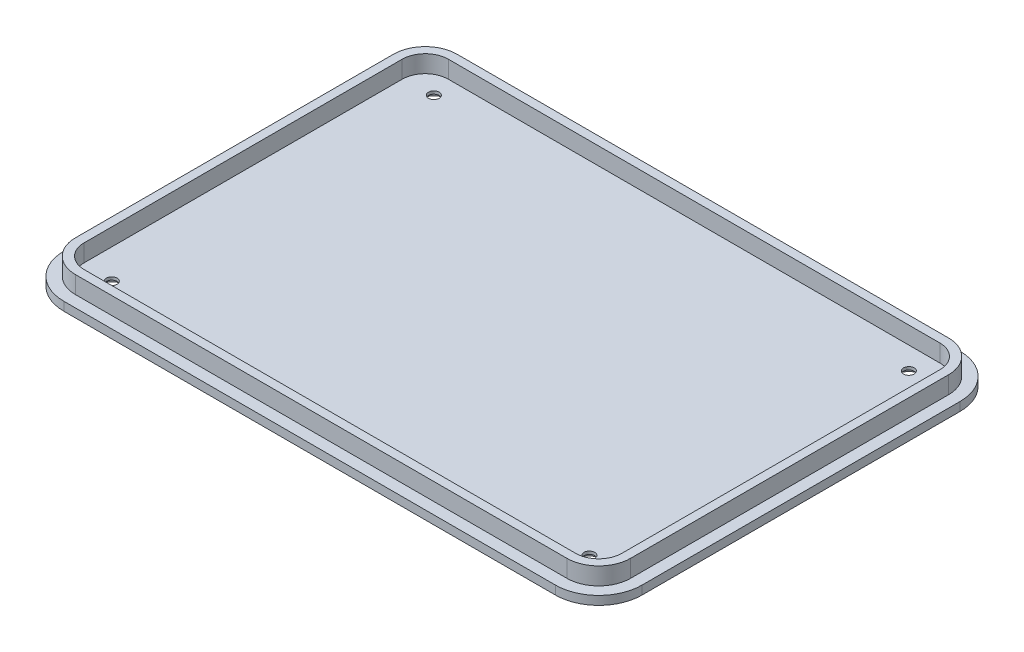
ISO-10303-21;
HEADER;
FILE_DESCRIPTION(('STEP AP214'),'2;1');
FILE_NAME('part.step','',(''),(''),'','','');
FILE_SCHEMA(('AUTOMOTIVE_DESIGN { 1 0 10303 214 1 1 1 1 }'));
ENDSEC;
DATA;
#1=APPLICATION_CONTEXT('core data for automotive mechanical design processes');
#2=APPLICATION_PROTOCOL_DEFINITION('international standard','automotive_design',2000,#1);
#3=PRODUCT_CONTEXT('',#1,'mechanical');
#4=PRODUCT('Part','Part','',(#3));
#5=PRODUCT_RELATED_PRODUCT_CATEGORY('part','',(#4));
#6=PRODUCT_DEFINITION_FORMATION('','',#4);
#7=PRODUCT_DEFINITION_CONTEXT('part definition',#1,'design');
#8=PRODUCT_DEFINITION('design','',#6,#7);
#9=PRODUCT_DEFINITION_SHAPE('','',#8);
#10=(LENGTH_UNIT() NAMED_UNIT(*) SI_UNIT(.MILLI.,.METRE.));
#11=(NAMED_UNIT(*) PLANE_ANGLE_UNIT() SI_UNIT($,.RADIAN.));
#12=(NAMED_UNIT(*) SI_UNIT($,.STERADIAN.) SOLID_ANGLE_UNIT());
#13=UNCERTAINTY_MEASURE_WITH_UNIT(LENGTH_MEASURE(1.E-05),#10,'distance_accuracy_value','');
#14=(GEOMETRIC_REPRESENTATION_CONTEXT(3) GLOBAL_UNCERTAINTY_ASSIGNED_CONTEXT((#13)) GLOBAL_UNIT_ASSIGNED_CONTEXT((#10,
#11,#12)) REPRESENTATION_CONTEXT('',''));
#15=CARTESIAN_POINT('',(0.,0.,0.));
#16=DIRECTION('',(0.,0.,1.));
#17=DIRECTION('',(1.,0.,0.));
#18=AXIS2_PLACEMENT_3D('',#15,#16,#17);
#19=CARTESIAN_POINT('',(0.,3.,0.));
#20=DIRECTION('',(0.,1.,0.));
#21=DIRECTION('',(0.,0.,1.));
#22=AXIS2_PLACEMENT_3D('',#19,#20,#21);
#23=PLANE('',#22);
#24=DIRECTION('',(-1.,0.,0.));
#25=VECTOR('',#24,1.);
#26=CARTESIAN_POINT('',(-100.,3.,-70.0000000000005));
#27=LINE('',#26,#25);
#28=CARTESIAN_POINT('',(85.0000000000001,3.,-70.0000000000005));
#29=VERTEX_POINT('',#28);
#30=CARTESIAN_POINT('',(-85.0000000000002,3.,-70.0000000000005));
#31=VERTEX_POINT('',#30);
#32=EDGE_CURVE('E329',#29,#31,#27,.T.);
#33=ORIENTED_EDGE('',*,*,#32,.T.);
#34=CARTESIAN_POINT('',(-85.0000000000002,3.,-55.0000000000005));
#35=DIRECTION('',(0.,1.,0.));
#36=DIRECTION('',(0.,0.,1.));
#37=AXIS2_PLACEMENT_3D('',#34,#35,#36);
#38=CIRCLE('',#37,15.);
#39=CARTESIAN_POINT('',(-100.,3.,-55.0000000000006));
#40=VERTEX_POINT('',#39);
#41=EDGE_CURVE('E373',#31,#40,#38,.T.);
#42=ORIENTED_EDGE('',*,*,#41,.T.);
#43=DIRECTION('',(0.,0.,1.));
#44=VECTOR('',#43,1.);
#45=CARTESIAN_POINT('',(-100.,3.,-70.0000000000005));
#46=LINE('',#45,#44);
#47=CARTESIAN_POINT('',(-100.000000000001,3.,54.9999999999994));
#48=VERTEX_POINT('',#47);
#49=EDGE_CURVE('E333',#40,#48,#46,.T.);
#50=ORIENTED_EDGE('',*,*,#49,.T.);
#51=CARTESIAN_POINT('',(-85.0000000000009,3.,54.9999999999995));
#52=DIRECTION('',(0.,1.,0.));
#53=DIRECTION('',(0.,0.,1.));
#54=AXIS2_PLACEMENT_3D('',#51,#52,#53);
#55=CIRCLE('',#54,15.);
#56=CARTESIAN_POINT('',(-85.0000000000009,3.,69.9999999999995));
#57=VERTEX_POINT('',#56);
#58=EDGE_CURVE('E367',#48,#57,#55,.T.);
#59=ORIENTED_EDGE('',*,*,#58,.T.);
#60=DIRECTION('',(1.,0.,0.));
#61=VECTOR('',#60,1.);
#62=CARTESIAN_POINT('',(-100.000000000001,3.,69.9999999999995));
#63=LINE('',#62,#61);
#64=CARTESIAN_POINT('',(85.0000000000005,3.,69.9999999999995));
#65=VERTEX_POINT('',#64);
#66=EDGE_CURVE('E336',#57,#65,#63,.T.);
#67=ORIENTED_EDGE('',*,*,#66,.T.);
#68=CARTESIAN_POINT('',(85.0000000000005,3.,54.9999999999995));
#69=DIRECTION('',(0.,1.,0.));
#70=DIRECTION('',(0.,0.,1.));
#71=AXIS2_PLACEMENT_3D('',#68,#69,#70);
#72=CIRCLE('',#71,15.);
#73=CARTESIAN_POINT('',(100.,3.,54.9999999999995));
#74=VERTEX_POINT('',#73);
#75=EDGE_CURVE('E369',#65,#74,#72,.T.);
#76=ORIENTED_EDGE('',*,*,#75,.T.);
#77=DIRECTION('',(0.,0.,-1.));
#78=VECTOR('',#77,1.);
#79=CARTESIAN_POINT('',(100.,3.,-70.0000000000005));
#80=LINE('',#79,#78);
#81=CARTESIAN_POINT('',(100.,3.,-55.0000000000006));
#82=VERTEX_POINT('',#81);
#83=EDGE_CURVE('E326',#74,#82,#80,.T.);
#84=ORIENTED_EDGE('',*,*,#83,.T.);
#85=CARTESIAN_POINT('',(85.0000000000001,3.,-55.0000000000005));
#86=DIRECTION('',(0.,1.,0.));
#87=DIRECTION('',(0.,0.,1.));
#88=AXIS2_PLACEMENT_3D('',#85,#86,#87);
#89=CIRCLE('',#88,15.);
#90=EDGE_CURVE('E371',#82,#29,#89,.T.);
#91=ORIENTED_EDGE('',*,*,#90,.T.);
#92=EDGE_LOOP('',(#33,#42,#50,#59,#67,#76,#84,#91));
#93=FACE_BOUND('',#92,.T.);
#94=DIRECTION('',(-1.,0.,0.));
#95=VECTOR('',#94,1.);
#96=CARTESIAN_POINT('',(85.0000000000001,3.,-66.0000000000005));
#97=LINE('',#96,#95);
#98=CARTESIAN_POINT('',(85.0000000000001,3.,-66.0000000000005));
#99=VERTEX_POINT('',#98);
#100=CARTESIAN_POINT('',(-85.0000000000002,3.,-66.0000000000005));
#101=VERTEX_POINT('',#100);
#102=EDGE_CURVE('E292',#99,#101,#97,.T.);
#103=ORIENTED_EDGE('',*,*,#102,.F.);
#104=CARTESIAN_POINT('',(85.0000000000001,3.,-55.0000000000005));
#105=DIRECTION('',(0.,1.,0.));
#106=DIRECTION('',(0.,0.,1.));
#107=AXIS2_PLACEMENT_3D('',#104,#105,#106);
#108=CIRCLE('',#107,11.);
#109=CARTESIAN_POINT('',(96.0000000000001,3.,-55.0000000000005));
#110=VERTEX_POINT('',#109);
#111=EDGE_CURVE('E218',#110,#99,#108,.T.);
#112=ORIENTED_EDGE('',*,*,#111,.F.);
#113=DIRECTION('',(0.,0.,-1.));
#114=VECTOR('',#113,1.);
#115=CARTESIAN_POINT('',(96.0000000000005,3.,54.9999999999995));
#116=LINE('',#115,#114);
#117=CARTESIAN_POINT('',(96.0000000000005,3.,54.9999999999995));
#118=VERTEX_POINT('',#117);
#119=EDGE_CURVE('E275',#118,#110,#116,.T.);
#120=ORIENTED_EDGE('',*,*,#119,.F.);
#121=CARTESIAN_POINT('',(85.0000000000005,3.,54.9999999999995));
#122=DIRECTION('',(0.,1.,0.));
#123=DIRECTION('',(0.,0.,1.));
#124=AXIS2_PLACEMENT_3D('',#121,#122,#123);
#125=CIRCLE('',#124,11.);
#126=CARTESIAN_POINT('',(85.0000000000005,3.,65.9999999999995));
#127=VERTEX_POINT('',#126);
#128=EDGE_CURVE('E302',#127,#118,#125,.T.);
#129=ORIENTED_EDGE('',*,*,#128,.F.);
#130=DIRECTION('',(1.,0.,0.));
#131=VECTOR('',#130,1.);
#132=CARTESIAN_POINT('',(-85.0000000000009,3.,65.9999999999995));
#133=LINE('',#132,#131);
#134=CARTESIAN_POINT('',(-85.0000000000009,3.,65.9999999999995));
#135=VERTEX_POINT('',#134);
#136=EDGE_CURVE('E300',#135,#127,#133,.T.);
#137=ORIENTED_EDGE('',*,*,#136,.F.);
#138=CARTESIAN_POINT('',(-85.0000000000009,3.,54.9999999999995));
#139=DIRECTION('',(0.,1.,0.));
#140=DIRECTION('',(0.,0.,1.));
#141=AXIS2_PLACEMENT_3D('',#138,#139,#140);
#142=CIRCLE('',#141,11.);
#143=CARTESIAN_POINT('',(-96.0000000000009,3.,54.9999999999994));
#144=VERTEX_POINT('',#143);
#145=EDGE_CURVE('E298',#144,#135,#142,.T.);
#146=ORIENTED_EDGE('',*,*,#145,.F.);
#147=DIRECTION('',(0.,0.,1.));
#148=VECTOR('',#147,1.);
#149=CARTESIAN_POINT('',(-96.0000000000002,3.,-55.0000000000006));
#150=LINE('',#149,#148);
#151=CARTESIAN_POINT('',(-96.0000000000002,3.,-55.0000000000006));
#152=VERTEX_POINT('',#151);
#153=EDGE_CURVE('E296',#152,#144,#150,.T.);
#154=ORIENTED_EDGE('',*,*,#153,.F.);
#155=CARTESIAN_POINT('',(-85.0000000000002,3.,-55.0000000000005));
#156=DIRECTION('',(0.,1.,0.));
#157=DIRECTION('',(0.,0.,1.));
#158=AXIS2_PLACEMENT_3D('',#155,#156,#157);
#159=CIRCLE('',#158,11.);
#160=EDGE_CURVE('E294',#101,#152,#159,.T.);
#161=ORIENTED_EDGE('',*,*,#160,.F.);
#162=EDGE_LOOP('',(#103,#112,#120,#129,#137,#146,#154,#161));
#163=FACE_BOUND('',#162,.T.);
#164=ADVANCED_FACE('F37',(#93,#163),#23,.T.);
#165=CARTESIAN_POINT('',(100.,3.,-70.0000000000005));
#166=DIRECTION('',(-1.,0.,0.));
#167=DIRECTION('',(0.,0.,1.));
#168=AXIS2_PLACEMENT_3D('',#165,#166,#167);
#169=PLANE('',#168);
#170=DIRECTION('',(0.,0.,-1.));
#171=VECTOR('',#170,1.);
#172=CARTESIAN_POINT('',(100.,0.,-70.0000000000005));
#173=LINE('',#172,#171);
#174=CARTESIAN_POINT('',(100.,0.,54.9999999999995));
#175=VERTEX_POINT('',#174);
#176=CARTESIAN_POINT('',(100.,0.,-55.0000000000006));
#177=VERTEX_POINT('',#176);
#178=EDGE_CURVE('E325',#175,#177,#173,.T.);
#179=ORIENTED_EDGE('',*,*,#178,.T.);
#180=DIRECTION('',(0.,-1.,0.));
#181=VECTOR('',#180,1.);
#182=CARTESIAN_POINT('',(100.,3.,-55.0000000000006));
#183=LINE('',#182,#181);
#184=EDGE_CURVE('E378',#177,#82,#183,.F.);
#185=ORIENTED_EDGE('',*,*,#184,.T.);
#186=ORIENTED_EDGE('',*,*,#83,.F.);
#187=DIRECTION('',(0.,-1.,0.));
#188=VECTOR('',#187,1.);
#189=CARTESIAN_POINT('',(100.,3.,54.9999999999995));
#190=LINE('',#189,#188);
#191=EDGE_CURVE('E375',#74,#175,#190,.T.);
#192=ORIENTED_EDGE('',*,*,#191,.T.);
#193=EDGE_LOOP('',(#179,#185,#186,#192));
#194=FACE_BOUND('',#193,.T.);
#195=ADVANCED_FACE('F461',(#194),#169,.F.);
#196=CARTESIAN_POINT('',(-100.,3.,-70.0000000000005));
#197=DIRECTION('',(0.,0.,1.));
#198=DIRECTION('',(1.,0.,0.));
#199=AXIS2_PLACEMENT_3D('',#196,#197,#198);
#200=PLANE('',#199);
#201=DIRECTION('',(-1.,0.,0.));
#202=VECTOR('',#201,1.);
#203=CARTESIAN_POINT('',(-100.,0.,-70.0000000000005));
#204=LINE('',#203,#202);
#205=CARTESIAN_POINT('',(85.0000000000001,0.,-70.0000000000005));
#206=VERTEX_POINT('',#205);
#207=CARTESIAN_POINT('',(-85.0000000000002,0.,-70.0000000000005));
#208=VERTEX_POINT('',#207);
#209=EDGE_CURVE('E342',#206,#208,#204,.T.);
#210=ORIENTED_EDGE('',*,*,#209,.T.);
#211=DIRECTION('',(0.,-1.,0.));
#212=VECTOR('',#211,1.);
#213=CARTESIAN_POINT('',(-85.0000000000002,3.,-70.0000000000005));
#214=LINE('',#213,#212);
#215=EDGE_CURVE('E365',#208,#31,#214,.F.);
#216=ORIENTED_EDGE('',*,*,#215,.T.);
#217=ORIENTED_EDGE('',*,*,#32,.F.);
#218=DIRECTION('',(0.,-1.,0.));
#219=VECTOR('',#218,1.);
#220=CARTESIAN_POINT('',(85.0000000000001,3.,-70.0000000000005));
#221=LINE('',#220,#219);
#222=EDGE_CURVE('E362',#29,#206,#221,.T.);
#223=ORIENTED_EDGE('',*,*,#222,.T.);
#224=EDGE_LOOP('',(#210,#216,#217,#223));
#225=FACE_BOUND('',#224,.T.);
#226=ADVANCED_FACE('F470',(#225),#200,.F.);
#227=CARTESIAN_POINT('',(-100.,3.,-70.0000000000005));
#228=DIRECTION('',(1.,0.,0.));
#229=DIRECTION('',(0.,0.,-1.));
#230=AXIS2_PLACEMENT_3D('',#227,#228,#229);
#231=PLANE('',#230);
#232=ORIENTED_EDGE('',*,*,#49,.F.);
#233=DIRECTION('',(0.,-1.,0.));
#234=VECTOR('',#233,1.);
#235=CARTESIAN_POINT('',(-100.,3.,-55.0000000000006));
#236=LINE('',#235,#234);
#237=CARTESIAN_POINT('',(-100.,0.,-55.0000000000006));
#238=VERTEX_POINT('',#237);
#239=EDGE_CURVE('E351',#40,#238,#236,.T.);
#240=ORIENTED_EDGE('',*,*,#239,.T.);
#241=DIRECTION('',(0.,0.,1.));
#242=VECTOR('',#241,1.);
#243=CARTESIAN_POINT('',(-100.,0.,-70.0000000000005));
#244=LINE('',#243,#242);
#245=CARTESIAN_POINT('',(-100.000000000001,0.,54.9999999999994));
#246=VERTEX_POINT('',#245);
#247=EDGE_CURVE('E345',#238,#246,#244,.T.);
#248=ORIENTED_EDGE('',*,*,#247,.T.);
#249=DIRECTION('',(0.,-1.,0.));
#250=VECTOR('',#249,1.);
#251=CARTESIAN_POINT('',(-100.000000000001,3.,54.9999999999994));
#252=LINE('',#251,#250);
#253=EDGE_CURVE('E339',#246,#48,#252,.F.);
#254=ORIENTED_EDGE('',*,*,#253,.T.);
#255=EDGE_LOOP('',(#232,#240,#248,#254));
#256=FACE_BOUND('',#255,.T.);
#257=ADVANCED_FACE('F444',(#256),#231,.F.);
#258=CARTESIAN_POINT('',(-100.000000000001,3.,69.9999999999995));
#259=DIRECTION('',(0.,0.,-1.));
#260=DIRECTION('',(-1.,0.,0.));
#261=AXIS2_PLACEMENT_3D('',#258,#259,#260);
#262=PLANE('',#261);
#263=DIRECTION('',(1.,0.,0.));
#264=VECTOR('',#263,1.);
#265=CARTESIAN_POINT('',(-100.000000000001,0.,69.9999999999995));
#266=LINE('',#265,#264);
#267=CARTESIAN_POINT('',(-85.0000000000009,0.,69.9999999999995));
#268=VERTEX_POINT('',#267);
#269=CARTESIAN_POINT('',(85.0000000000005,0.,69.9999999999995));
#270=VERTEX_POINT('',#269);
#271=EDGE_CURVE('E330',#268,#270,#266,.T.);
#272=ORIENTED_EDGE('',*,*,#271,.T.);
#273=DIRECTION('',(0.,-1.,0.));
#274=VECTOR('',#273,1.);
#275=CARTESIAN_POINT('',(85.0000000000005,3.,69.9999999999995));
#276=LINE('',#275,#274);
#277=EDGE_CURVE('E11',#270,#65,#276,.F.);
#278=ORIENTED_EDGE('',*,*,#277,.T.);
#279=ORIENTED_EDGE('',*,*,#66,.F.);
#280=DIRECTION('',(0.,-1.,0.));
#281=VECTOR('',#280,1.);
#282=CARTESIAN_POINT('',(-85.0000000000009,3.,69.9999999999995));
#283=LINE('',#282,#281);
#284=EDGE_CURVE('E46',#57,#268,#283,.T.);
#285=ORIENTED_EDGE('',*,*,#284,.T.);
#286=EDGE_LOOP('',(#272,#278,#279,#285));
#287=FACE_BOUND('',#286,.T.);
#288=ADVANCED_FACE('F435',(#287),#262,.F.);
#289=CARTESIAN_POINT('',(0.,0.,0.));
#290=DIRECTION('',(0.,1.,0.));
#291=DIRECTION('',(0.,0.,1.));
#292=AXIS2_PLACEMENT_3D('',#289,#290,#291);
#293=PLANE('',#292);
#294=CARTESIAN_POINT('',(82.0000000000005,0.,-55.2499999999995));
#295=DIRECTION('',(0.,1.,0.));
#296=DIRECTION('',(0.,0.,1.));
#297=AXIS2_PLACEMENT_3D('',#294,#295,#296);
#298=CIRCLE('',#297,4.00000000000001);
#299=CARTESIAN_POINT('',(82.0000000000005,0.,-51.2499999999995));
#300=VERTEX_POINT('',#299);
#301=EDGE_CURVE('E392',#300,#300,#298,.T.);
#302=ORIENTED_EDGE('',*,*,#301,.T.);
#303=EDGE_LOOP('',(#302));
#304=FACE_BOUND('',#303,.T.);
#305=CARTESIAN_POINT('',(82.0000000000005,0.,55.2499999999995));
#306=DIRECTION('',(0.,-1.,0.));
#307=DIRECTION('',(0.,0.,-1.));
#308=AXIS2_PLACEMENT_3D('',#305,#306,#307);
#309=CIRCLE('',#308,4.00000000000001);
#310=CARTESIAN_POINT('',(82.0000000000005,0.,51.2499999999995));
#311=VERTEX_POINT('',#310);
#312=EDGE_CURVE('E408',#311,#311,#309,.T.);
#313=ORIENTED_EDGE('',*,*,#312,.F.);
#314=EDGE_LOOP('',(#313));
#315=FACE_BOUND('',#314,.T.);
#316=CARTESIAN_POINT('',(-82.7300000000002,0.,-55.6999999999995));
#317=DIRECTION('',(0.,1.,0.));
#318=DIRECTION('',(0.,0.,1.));
#319=AXIS2_PLACEMENT_3D('',#316,#317,#318);
#320=CIRCLE('',#319,4.00000000000001);
#321=CARTESIAN_POINT('',(-82.7300000000002,0.,-51.6999999999995));
#322=VERTEX_POINT('',#321);
#323=EDGE_CURVE('E385',#322,#322,#320,.T.);
#324=ORIENTED_EDGE('',*,*,#323,.T.);
#325=EDGE_LOOP('',(#324));
#326=FACE_BOUND('',#325,.T.);
#327=CARTESIAN_POINT('',(-82.7300000000002,0.,55.6999999999995));
#328=DIRECTION('',(0.,-1.,0.));
#329=DIRECTION('',(0.,0.,-1.));
#330=AXIS2_PLACEMENT_3D('',#327,#328,#329);
#331=CIRCLE('',#330,4.00000000000001);
#332=CARTESIAN_POINT('',(-82.7300000000002,0.,51.6999999999995));
#333=VERTEX_POINT('',#332);
#334=EDGE_CURVE('E422',#333,#333,#331,.T.);
#335=ORIENTED_EDGE('',*,*,#334,.F.);
#336=EDGE_LOOP('',(#335));
#337=FACE_BOUND('',#336,.T.);
#338=ORIENTED_EDGE('',*,*,#247,.F.);
#339=CARTESIAN_POINT('',(-85.0000000000002,0.,-55.0000000000005));
#340=DIRECTION('',(0.,1.,0.));
#341=DIRECTION('',(0.,0.,1.));
#342=AXIS2_PLACEMENT_3D('',#339,#340,#341);
#343=CIRCLE('',#342,15.);
#344=EDGE_CURVE('E360',#238,#208,#343,.F.);
#345=ORIENTED_EDGE('',*,*,#344,.T.);
#346=ORIENTED_EDGE('',*,*,#209,.F.);
#347=CARTESIAN_POINT('',(85.0000000000001,0.,-55.0000000000005));
#348=DIRECTION('',(0.,1.,0.));
#349=DIRECTION('',(0.,0.,1.));
#350=AXIS2_PLACEMENT_3D('',#347,#348,#349);
#351=CIRCLE('',#350,15.);
#352=EDGE_CURVE('E358',#206,#177,#351,.F.);
#353=ORIENTED_EDGE('',*,*,#352,.T.);
#354=ORIENTED_EDGE('',*,*,#178,.F.);
#355=CARTESIAN_POINT('',(85.0000000000005,0.,54.9999999999995));
#356=DIRECTION('',(0.,1.,0.));
#357=DIRECTION('',(0.,0.,1.));
#358=AXIS2_PLACEMENT_3D('',#355,#356,#357);
#359=CIRCLE('',#358,15.);
#360=EDGE_CURVE('E356',#175,#270,#359,.F.);
#361=ORIENTED_EDGE('',*,*,#360,.T.);
#362=ORIENTED_EDGE('',*,*,#271,.F.);
#363=CARTESIAN_POINT('',(-85.0000000000009,0.,54.9999999999995));
#364=DIRECTION('',(0.,1.,0.));
#365=DIRECTION('',(0.,0.,1.));
#366=AXIS2_PLACEMENT_3D('',#363,#364,#365);
#367=CIRCLE('',#366,15.);
#368=EDGE_CURVE('E354',#268,#246,#367,.F.);
#369=ORIENTED_EDGE('',*,*,#368,.T.);
#370=EDGE_LOOP('',(#338,#345,#346,#353,#354,#361,#362,#369));
#371=FACE_BOUND('',#370,.T.);
#372=ADVANCED_FACE('F431',(#304,#315,#326,#337,#371),#293,.F.);
#373=CARTESIAN_POINT('',(-85.0000000000002,3.,-55.0000000000005));
#374=DIRECTION('',(0.,-1.,0.));
#375=DIRECTION('',(0.,0.,-1.));
#376=AXIS2_PLACEMENT_3D('',#373,#374,#375);
#377=CYLINDRICAL_SURFACE('',#376,15.);
#378=ORIENTED_EDGE('',*,*,#41,.F.);
#379=ORIENTED_EDGE('',*,*,#215,.F.);
#380=ORIENTED_EDGE('',*,*,#344,.F.);
#381=ORIENTED_EDGE('',*,*,#239,.F.);
#382=EDGE_LOOP('',(#378,#379,#380,#381));
#383=FACE_BOUND('',#382,.T.);
#384=ADVANCED_FACE('F434',(#383),#377,.T.);
#385=CARTESIAN_POINT('',(85.0000000000001,3.,-55.0000000000005));
#386=DIRECTION('',(0.,-1.,0.));
#387=DIRECTION('',(0.,0.,-1.));
#388=AXIS2_PLACEMENT_3D('',#385,#386,#387);
#389=CYLINDRICAL_SURFACE('',#388,15.);
#390=ORIENTED_EDGE('',*,*,#90,.F.);
#391=ORIENTED_EDGE('',*,*,#184,.F.);
#392=ORIENTED_EDGE('',*,*,#352,.F.);
#393=ORIENTED_EDGE('',*,*,#222,.F.);
#394=EDGE_LOOP('',(#390,#391,#392,#393));
#395=FACE_BOUND('',#394,.T.);
#396=ADVANCED_FACE('F465',(#395),#389,.T.);
#397=CARTESIAN_POINT('',(85.0000000000005,3.,54.9999999999995));
#398=DIRECTION('',(0.,-1.,0.));
#399=DIRECTION('',(0.,0.,-1.));
#400=AXIS2_PLACEMENT_3D('',#397,#398,#399);
#401=CYLINDRICAL_SURFACE('',#400,15.);
#402=ORIENTED_EDGE('',*,*,#75,.F.);
#403=ORIENTED_EDGE('',*,*,#277,.F.);
#404=ORIENTED_EDGE('',*,*,#360,.F.);
#405=ORIENTED_EDGE('',*,*,#191,.F.);
#406=EDGE_LOOP('',(#402,#403,#404,#405));
#407=FACE_BOUND('',#406,.T.);
#408=ADVANCED_FACE('F456',(#407),#401,.T.);
#409=CARTESIAN_POINT('',(-85.0000000000009,3.,54.9999999999995));
#410=DIRECTION('',(0.,-1.,0.));
#411=DIRECTION('',(0.,0.,-1.));
#412=AXIS2_PLACEMENT_3D('',#409,#410,#411);
#413=CYLINDRICAL_SURFACE('',#412,15.);
#414=ORIENTED_EDGE('',*,*,#58,.F.);
#415=ORIENTED_EDGE('',*,*,#253,.F.);
#416=ORIENTED_EDGE('',*,*,#368,.F.);
#417=ORIENTED_EDGE('',*,*,#284,.F.);
#418=EDGE_LOOP('',(#414,#415,#416,#417));
#419=FACE_BOUND('',#418,.T.);
#420=ADVANCED_FACE('F39',(#419),#413,.T.);
#421=CARTESIAN_POINT('',(85.0000000000001,9.,-55.0000000000005));
#422=DIRECTION('',(0.,1.,0.));
#423=DIRECTION('',(0.,0.,1.));
#424=AXIS2_PLACEMENT_3D('',#421,#422,#423);
#425=PLANE('',#424);
#426=CARTESIAN_POINT('',(85.0000000000001,9.,-55.0000000000005));
#427=DIRECTION('',(0.,1.,0.));
#428=DIRECTION('',(0.,0.,1.));
#429=AXIS2_PLACEMENT_3D('',#426,#427,#428);
#430=CIRCLE('',#429,11.);
#431=CARTESIAN_POINT('',(96.0000000000001,9.,-55.0000000000005));
#432=VERTEX_POINT('',#431);
#433=CARTESIAN_POINT('',(85.0000000000001,9.,-66.0000000000005));
#434=VERTEX_POINT('',#433);
#435=EDGE_CURVE('E271',#432,#434,#430,.T.);
#436=ORIENTED_EDGE('',*,*,#435,.T.);
#437=DIRECTION('',(-1.,0.,0.));
#438=VECTOR('',#437,1.);
#439=CARTESIAN_POINT('',(85.0000000000001,9.,-66.0000000000005));
#440=LINE('',#439,#438);
#441=CARTESIAN_POINT('',(-85.0000000000002,9.,-66.0000000000005));
#442=VERTEX_POINT('',#441);
#443=EDGE_CURVE('E274',#434,#442,#440,.T.);
#444=ORIENTED_EDGE('',*,*,#443,.T.);
#445=CARTESIAN_POINT('',(-85.0000000000002,9.,-55.0000000000005));
#446=DIRECTION('',(0.,1.,0.));
#447=DIRECTION('',(0.,0.,1.));
#448=AXIS2_PLACEMENT_3D('',#445,#446,#447);
#449=CIRCLE('',#448,11.);
#450=CARTESIAN_POINT('',(-96.0000000000002,9.,-55.0000000000006));
#451=VERTEX_POINT('',#450);
#452=EDGE_CURVE('E277',#442,#451,#449,.T.);
#453=ORIENTED_EDGE('',*,*,#452,.T.);
#454=DIRECTION('',(0.,0.,1.));
#455=VECTOR('',#454,1.);
#456=CARTESIAN_POINT('',(-96.0000000000002,9.,-55.0000000000006));
#457=LINE('',#456,#455);
#458=CARTESIAN_POINT('',(-96.0000000000009,9.,54.9999999999994));
#459=VERTEX_POINT('',#458);
#460=EDGE_CURVE('E279',#451,#459,#457,.T.);
#461=ORIENTED_EDGE('',*,*,#460,.T.);
#462=CARTESIAN_POINT('',(-85.0000000000009,9.,54.9999999999995));
#463=DIRECTION('',(0.,1.,0.));
#464=DIRECTION('',(0.,0.,1.));
#465=AXIS2_PLACEMENT_3D('',#462,#463,#464);
#466=CIRCLE('',#465,11.);
#467=CARTESIAN_POINT('',(-85.0000000000009,9.,65.9999999999995));
#468=VERTEX_POINT('',#467);
#469=EDGE_CURVE('E281',#459,#468,#466,.T.);
#470=ORIENTED_EDGE('',*,*,#469,.T.);
#471=DIRECTION('',(1.,0.,0.));
#472=VECTOR('',#471,1.);
#473=CARTESIAN_POINT('',(-85.0000000000009,9.,65.9999999999995));
#474=LINE('',#473,#472);
#475=CARTESIAN_POINT('',(85.0000000000005,9.,65.9999999999995));
#476=VERTEX_POINT('',#475);
#477=EDGE_CURVE('E283',#468,#476,#474,.T.);
#478=ORIENTED_EDGE('',*,*,#477,.T.);
#479=CARTESIAN_POINT('',(85.0000000000005,9.,54.9999999999995));
#480=DIRECTION('',(0.,1.,0.));
#481=DIRECTION('',(0.,0.,1.));
#482=AXIS2_PLACEMENT_3D('',#479,#480,#481);
#483=CIRCLE('',#482,11.);
#484=CARTESIAN_POINT('',(96.0000000000005,9.,54.9999999999995));
#485=VERTEX_POINT('',#484);
#486=EDGE_CURVE('E285',#476,#485,#483,.T.);
#487=ORIENTED_EDGE('',*,*,#486,.T.);
#488=DIRECTION('',(0.,0.,-1.));
#489=VECTOR('',#488,1.);
#490=CARTESIAN_POINT('',(96.0000000000005,9.,54.9999999999995));
#491=LINE('',#490,#489);
#492=EDGE_CURVE('E287',#485,#432,#491,.T.);
#493=ORIENTED_EDGE('',*,*,#492,.T.);
#494=EDGE_LOOP('',(#436,#444,#453,#461,#470,#478,#487,#493));
#495=FACE_BOUND('',#494,.T.);
#496=DIRECTION('',(0.,0.,1.));
#497=VECTOR('',#496,1.);
#498=CARTESIAN_POINT('',(-93.0000000000002,9.,-55.0000000000006));
#499=LINE('',#498,#497);
#500=CARTESIAN_POINT('',(-93.0000000000002,9.,-55.0000000000006));
#501=VERTEX_POINT('',#500);
#502=CARTESIAN_POINT('',(-93.0000000000009,9.,54.9999999999995));
#503=VERTEX_POINT('',#502);
#504=EDGE_CURVE('E210',#501,#503,#499,.T.);
#505=ORIENTED_EDGE('',*,*,#504,.F.);
#506=CARTESIAN_POINT('',(-85.0000000000002,9.,-55.0000000000005));
#507=DIRECTION('',(0.,1.,0.));
#508=DIRECTION('',(0.,0.,1.));
#509=AXIS2_PLACEMENT_3D('',#506,#507,#508);
#510=CIRCLE('',#509,8.);
#511=CARTESIAN_POINT('',(-85.0000000000002,9.,-63.0000000000005));
#512=VERTEX_POINT('',#511);
#513=EDGE_CURVE('E201',#512,#501,#510,.T.);
#514=ORIENTED_EDGE('',*,*,#513,.F.);
#515=DIRECTION('',(-1.,0.,0.));
#516=VECTOR('',#515,1.);
#517=CARTESIAN_POINT('',(85.0000000000001,9.,-63.0000000000005));
#518=LINE('',#517,#516);
#519=CARTESIAN_POINT('',(85.0000000000001,9.,-63.0000000000005));
#520=VERTEX_POINT('',#519);
#521=EDGE_CURVE('E238',#520,#512,#518,.T.);
#522=ORIENTED_EDGE('',*,*,#521,.F.);
#523=CARTESIAN_POINT('',(85.0000000000001,9.,-55.0000000000005));
#524=DIRECTION('',(0.,1.,0.));
#525=DIRECTION('',(0.,0.,1.));
#526=AXIS2_PLACEMENT_3D('',#523,#524,#525);
#527=CIRCLE('',#526,7.99999999999999);
#528=CARTESIAN_POINT('',(93.0000000000001,9.,-55.0000000000005));
#529=VERTEX_POINT('',#528);
#530=EDGE_CURVE('E235',#529,#520,#527,.T.);
#531=ORIENTED_EDGE('',*,*,#530,.F.);
#532=DIRECTION('',(0.,0.,-1.));
#533=VECTOR('',#532,1.);
#534=CARTESIAN_POINT('',(93.0000000000005,9.,54.9999999999995));
#535=LINE('',#534,#533);
#536=CARTESIAN_POINT('',(93.0000000000005,9.,54.9999999999995));
#537=VERTEX_POINT('',#536);
#538=EDGE_CURVE('E233',#537,#529,#535,.T.);
#539=ORIENTED_EDGE('',*,*,#538,.F.);
#540=CARTESIAN_POINT('',(85.0000000000005,9.,54.9999999999995));
#541=DIRECTION('',(0.,1.,0.));
#542=DIRECTION('',(0.,0.,1.));
#543=AXIS2_PLACEMENT_3D('',#540,#541,#542);
#544=CIRCLE('',#543,8.);
#545=CARTESIAN_POINT('',(85.0000000000005,9.,62.9999999999995));
#546=VERTEX_POINT('',#545);
#547=EDGE_CURVE('E231',#546,#537,#544,.T.);
#548=ORIENTED_EDGE('',*,*,#547,.F.);
#549=DIRECTION('',(1.,0.,0.));
#550=VECTOR('',#549,1.);
#551=CARTESIAN_POINT('',(-85.0000000000009,9.,62.9999999999995));
#552=LINE('',#551,#550);
#553=CARTESIAN_POINT('',(-85.0000000000009,9.,62.9999999999995));
#554=VERTEX_POINT('',#553);
#555=EDGE_CURVE('E226',#554,#546,#552,.T.);
#556=ORIENTED_EDGE('',*,*,#555,.F.);
#557=CARTESIAN_POINT('',(-85.0000000000009,9.,54.9999999999995));
#558=DIRECTION('',(0.,1.,0.));
#559=DIRECTION('',(0.,0.,1.));
#560=AXIS2_PLACEMENT_3D('',#557,#558,#559);
#561=CIRCLE('',#560,7.99999999999999);
#562=EDGE_CURVE('E224',#503,#554,#561,.T.);
#563=ORIENTED_EDGE('',*,*,#562,.F.);
#564=EDGE_LOOP('',(#505,#514,#522,#531,#539,#548,#556,#563));
#565=FACE_BOUND('',#564,.T.);
#566=ADVANCED_FACE('F222',(#495,#565),#425,.T.);
#567=CARTESIAN_POINT('',(85.0000000000001,9.,-55.0000000000005));
#568=DIRECTION('',(0.,-1.,0.));
#569=DIRECTION('',(0.,0.,-1.));
#570=AXIS2_PLACEMENT_3D('',#567,#568,#569);
#571=CYLINDRICAL_SURFACE('',#570,11.);
#572=ORIENTED_EDGE('',*,*,#111,.T.);
#573=DIRECTION('',(0.,-1.,0.));
#574=VECTOR('',#573,1.);
#575=CARTESIAN_POINT('',(85.0000000000001,9.,-66.0000000000005));
#576=LINE('',#575,#574);
#577=EDGE_CURVE('E323',#434,#99,#576,.T.);
#578=ORIENTED_EDGE('',*,*,#577,.F.);
#579=ORIENTED_EDGE('',*,*,#435,.F.);
#580=DIRECTION('',(0.,-1.,0.));
#581=VECTOR('',#580,1.);
#582=CARTESIAN_POINT('',(96.0000000000001,9.,-55.0000000000005));
#583=LINE('',#582,#581);
#584=EDGE_CURVE('E289',#432,#110,#583,.T.);
#585=ORIENTED_EDGE('',*,*,#584,.T.);
#586=EDGE_LOOP('',(#572,#578,#579,#585));
#587=FACE_BOUND('',#586,.T.);
#588=ADVANCED_FACE('F553',(#587),#571,.T.);
#589=CARTESIAN_POINT('',(85.0000000000001,9.,-66.0000000000005));
#590=DIRECTION('',(0.,0.,1.));
#591=DIRECTION('',(1.,0.,0.));
#592=AXIS2_PLACEMENT_3D('',#589,#590,#591);
#593=PLANE('',#592);
#594=ORIENTED_EDGE('',*,*,#102,.T.);
#595=DIRECTION('',(0.,-1.,0.));
#596=VECTOR('',#595,1.);
#597=CARTESIAN_POINT('',(-85.0000000000002,9.,-66.0000000000005));
#598=LINE('',#597,#596);
#599=EDGE_CURVE('E320',#442,#101,#598,.T.);
#600=ORIENTED_EDGE('',*,*,#599,.F.);
#601=ORIENTED_EDGE('',*,*,#443,.F.);
#602=ORIENTED_EDGE('',*,*,#577,.T.);
#603=EDGE_LOOP('',(#594,#600,#601,#602));
#604=FACE_BOUND('',#603,.T.);
#605=ADVANCED_FACE('F576',(#604),#593,.F.);
#606=CARTESIAN_POINT('',(-85.0000000000002,9.,-55.0000000000005));
#607=DIRECTION('',(0.,-1.,0.));
#608=DIRECTION('',(0.,0.,-1.));
#609=AXIS2_PLACEMENT_3D('',#606,#607,#608);
#610=CYLINDRICAL_SURFACE('',#609,11.);
#611=ORIENTED_EDGE('',*,*,#160,.T.);
#612=DIRECTION('',(0.,-1.,0.));
#613=VECTOR('',#612,1.);
#614=CARTESIAN_POINT('',(-96.0000000000002,9.,-55.0000000000006));
#615=LINE('',#614,#613);
#616=EDGE_CURVE('E317',#451,#152,#615,.T.);
#617=ORIENTED_EDGE('',*,*,#616,.F.);
#618=ORIENTED_EDGE('',*,*,#452,.F.);
#619=ORIENTED_EDGE('',*,*,#599,.T.);
#620=EDGE_LOOP('',(#611,#617,#618,#619));
#621=FACE_BOUND('',#620,.T.);
#622=ADVANCED_FACE('F572',(#621),#610,.T.);
#623=CARTESIAN_POINT('',(-96.0000000000002,9.,-55.0000000000006));
#624=DIRECTION('',(1.,0.,0.));
#625=DIRECTION('',(0.,0.,-1.));
#626=AXIS2_PLACEMENT_3D('',#623,#624,#625);
#627=PLANE('',#626);
#628=ORIENTED_EDGE('',*,*,#153,.T.);
#629=DIRECTION('',(0.,-1.,0.));
#630=VECTOR('',#629,1.);
#631=CARTESIAN_POINT('',(-96.0000000000009,9.,54.9999999999994));
#632=LINE('',#631,#630);
#633=EDGE_CURVE('E314',#459,#144,#632,.T.);
#634=ORIENTED_EDGE('',*,*,#633,.F.);
#635=ORIENTED_EDGE('',*,*,#460,.F.);
#636=ORIENTED_EDGE('',*,*,#616,.T.);
#637=EDGE_LOOP('',(#628,#634,#635,#636));
#638=FACE_BOUND('',#637,.T.);
#639=ADVANCED_FACE('F568',(#638),#627,.F.);
#640=CARTESIAN_POINT('',(-85.0000000000009,9.,54.9999999999995));
#641=DIRECTION('',(0.,-1.,0.));
#642=DIRECTION('',(0.,0.,-1.));
#643=AXIS2_PLACEMENT_3D('',#640,#641,#642);
#644=CYLINDRICAL_SURFACE('',#643,11.);
#645=ORIENTED_EDGE('',*,*,#145,.T.);
#646=DIRECTION('',(0.,-1.,0.));
#647=VECTOR('',#646,1.);
#648=CARTESIAN_POINT('',(-85.0000000000009,9.,65.9999999999995));
#649=LINE('',#648,#647);
#650=EDGE_CURVE('E311',#468,#135,#649,.T.);
#651=ORIENTED_EDGE('',*,*,#650,.F.);
#652=ORIENTED_EDGE('',*,*,#469,.F.);
#653=ORIENTED_EDGE('',*,*,#633,.T.);
#654=EDGE_LOOP('',(#645,#651,#652,#653));
#655=FACE_BOUND('',#654,.T.);
#656=ADVANCED_FACE('F564',(#655),#644,.T.);
#657=CARTESIAN_POINT('',(-85.0000000000009,9.,65.9999999999995));
#658=DIRECTION('',(0.,0.,-1.));
#659=DIRECTION('',(-1.,0.,0.));
#660=AXIS2_PLACEMENT_3D('',#657,#658,#659);
#661=PLANE('',#660);
#662=ORIENTED_EDGE('',*,*,#136,.T.);
#663=DIRECTION('',(0.,-1.,0.));
#664=VECTOR('',#663,1.);
#665=CARTESIAN_POINT('',(85.0000000000005,9.,65.9999999999995));
#666=LINE('',#665,#664);
#667=EDGE_CURVE('E308',#476,#127,#666,.T.);
#668=ORIENTED_EDGE('',*,*,#667,.F.);
#669=ORIENTED_EDGE('',*,*,#477,.F.);
#670=ORIENTED_EDGE('',*,*,#650,.T.);
#671=EDGE_LOOP('',(#662,#668,#669,#670));
#672=FACE_BOUND('',#671,.T.);
#673=ADVANCED_FACE('F560',(#672),#661,.F.);
#674=CARTESIAN_POINT('',(85.0000000000005,9.,54.9999999999995));
#675=DIRECTION('',(0.,-1.,0.));
#676=DIRECTION('',(0.,0.,-1.));
#677=AXIS2_PLACEMENT_3D('',#674,#675,#676);
#678=CYLINDRICAL_SURFACE('',#677,11.);
#679=ORIENTED_EDGE('',*,*,#128,.T.);
#680=DIRECTION('',(0.,-1.,0.));
#681=VECTOR('',#680,1.);
#682=CARTESIAN_POINT('',(96.0000000000005,9.,54.9999999999995));
#683=LINE('',#682,#681);
#684=EDGE_CURVE('E54',#485,#118,#683,.T.);
#685=ORIENTED_EDGE('',*,*,#684,.F.);
#686=ORIENTED_EDGE('',*,*,#486,.F.);
#687=ORIENTED_EDGE('',*,*,#667,.T.);
#688=EDGE_LOOP('',(#679,#685,#686,#687));
#689=FACE_BOUND('',#688,.T.);
#690=ADVANCED_FACE('F557',(#689),#678,.T.);
#691=CARTESIAN_POINT('',(96.0000000000005,9.,54.9999999999995));
#692=DIRECTION('',(-1.,0.,0.));
#693=DIRECTION('',(0.,0.,1.));
#694=AXIS2_PLACEMENT_3D('',#691,#692,#693);
#695=PLANE('',#694);
#696=ORIENTED_EDGE('',*,*,#119,.T.);
#697=ORIENTED_EDGE('',*,*,#584,.F.);
#698=ORIENTED_EDGE('',*,*,#492,.F.);
#699=ORIENTED_EDGE('',*,*,#684,.T.);
#700=EDGE_LOOP('',(#696,#697,#698,#699));
#701=FACE_BOUND('',#700,.T.);
#702=ADVANCED_FACE('F550',(#701),#695,.F.);
#703=CARTESIAN_POINT('',(-85.0000000000002,9.,-55.0000000000005));
#704=DIRECTION('',(0.,-1.,0.));
#705=DIRECTION('',(0.,0.,-1.));
#706=AXIS2_PLACEMENT_3D('',#703,#704,#705);
#707=CYLINDRICAL_SURFACE('',#706,8.);
#708=CARTESIAN_POINT('',(-85.0000000000002,3.,-55.0000000000005));
#709=DIRECTION('',(0.,1.,0.));
#710=DIRECTION('',(0.,0.,1.));
#711=AXIS2_PLACEMENT_3D('',#708,#709,#710);
#712=CIRCLE('',#711,8.);
#713=CARTESIAN_POINT('',(-85.0000000000002,3.,-63.0000000000005));
#714=VERTEX_POINT('',#713);
#715=CARTESIAN_POINT('',(-93.0000000000002,3.,-55.0000000000006));
#716=VERTEX_POINT('',#715);
#717=EDGE_CURVE('E62',#714,#716,#712,.T.);
#718=ORIENTED_EDGE('',*,*,#717,.F.);
#719=DIRECTION('',(0.,-1.,0.));
#720=VECTOR('',#719,1.);
#721=CARTESIAN_POINT('',(-85.0000000000002,9.,-63.0000000000005));
#722=LINE('',#721,#720);
#723=EDGE_CURVE('E206',#512,#714,#722,.T.);
#724=ORIENTED_EDGE('',*,*,#723,.F.);
#725=ORIENTED_EDGE('',*,*,#513,.T.);
#726=DIRECTION('',(0.,-1.,0.));
#727=VECTOR('',#726,1.);
#728=CARTESIAN_POINT('',(-93.0000000000002,9.,-55.0000000000006));
#729=LINE('',#728,#727);
#730=EDGE_CURVE('E204',#501,#716,#729,.T.);
#731=ORIENTED_EDGE('',*,*,#730,.T.);
#732=EDGE_LOOP('',(#718,#724,#725,#731));
#733=FACE_BOUND('',#732,.T.);
#734=ADVANCED_FACE('F203',(#733),#707,.F.);
#735=CARTESIAN_POINT('',(-93.0000000000002,9.,-55.0000000000006));
#736=DIRECTION('',(1.,0.,0.));
#737=DIRECTION('',(0.,0.,-1.));
#738=AXIS2_PLACEMENT_3D('',#735,#736,#737);
#739=PLANE('',#738);
#740=DIRECTION('',(0.,0.,1.));
#741=VECTOR('',#740,1.);
#742=CARTESIAN_POINT('',(-93.0000000000002,3.,-55.0000000000006));
#743=LINE('',#742,#741);
#744=CARTESIAN_POINT('',(-93.0000000000009,3.,54.9999999999995));
#745=VERTEX_POINT('',#744);
#746=EDGE_CURVE('E217',#716,#745,#743,.T.);
#747=ORIENTED_EDGE('',*,*,#746,.F.);
#748=ORIENTED_EDGE('',*,*,#730,.F.);
#749=ORIENTED_EDGE('',*,*,#504,.T.);
#750=DIRECTION('',(0.,-1.,0.));
#751=VECTOR('',#750,1.);
#752=CARTESIAN_POINT('',(-93.0000000000009,9.,54.9999999999995));
#753=LINE('',#752,#751);
#754=EDGE_CURVE('E219',#503,#745,#753,.T.);
#755=ORIENTED_EDGE('',*,*,#754,.T.);
#756=EDGE_LOOP('',(#747,#748,#749,#755));
#757=FACE_BOUND('',#756,.T.);
#758=ADVANCED_FACE('F214',(#757),#739,.T.);
#759=CARTESIAN_POINT('',(-85.0000000000009,9.,54.9999999999995));
#760=DIRECTION('',(0.,-1.,0.));
#761=DIRECTION('',(0.,0.,-1.));
#762=AXIS2_PLACEMENT_3D('',#759,#760,#761);
#763=CYLINDRICAL_SURFACE('',#762,7.99999999999999);
#764=CARTESIAN_POINT('',(-85.0000000000009,3.,54.9999999999995));
#765=DIRECTION('',(0.,1.,0.));
#766=DIRECTION('',(0.,0.,1.));
#767=AXIS2_PLACEMENT_3D('',#764,#765,#766);
#768=CIRCLE('',#767,7.99999999999999);
#769=CARTESIAN_POINT('',(-85.0000000000009,3.,62.9999999999995));
#770=VERTEX_POINT('',#769);
#771=EDGE_CURVE('E243',#745,#770,#768,.T.);
#772=ORIENTED_EDGE('',*,*,#771,.F.);
#773=ORIENTED_EDGE('',*,*,#754,.F.);
#774=ORIENTED_EDGE('',*,*,#562,.T.);
#775=DIRECTION('',(0.,-1.,0.));
#776=VECTOR('',#775,1.);
#777=CARTESIAN_POINT('',(-85.0000000000009,9.,62.9999999999995));
#778=LINE('',#777,#776);
#779=EDGE_CURVE('E267',#554,#770,#778,.T.);
#780=ORIENTED_EDGE('',*,*,#779,.T.);
#781=EDGE_LOOP('',(#772,#773,#774,#780));
#782=FACE_BOUND('',#781,.T.);
#783=ADVANCED_FACE('F541',(#782),#763,.F.);
#784=CARTESIAN_POINT('',(-85.0000000000009,9.,62.9999999999995));
#785=DIRECTION('',(0.,0.,-1.));
#786=DIRECTION('',(-1.,0.,0.));
#787=AXIS2_PLACEMENT_3D('',#784,#785,#786);
#788=PLANE('',#787);
#789=DIRECTION('',(1.,0.,0.));
#790=VECTOR('',#789,1.);
#791=CARTESIAN_POINT('',(-85.0000000000009,3.,62.9999999999995));
#792=LINE('',#791,#790);
#793=CARTESIAN_POINT('',(85.0000000000005,3.,62.9999999999995));
#794=VERTEX_POINT('',#793);
#795=EDGE_CURVE('E245',#770,#794,#792,.T.);
#796=ORIENTED_EDGE('',*,*,#795,.F.);
#797=ORIENTED_EDGE('',*,*,#779,.F.);
#798=ORIENTED_EDGE('',*,*,#555,.T.);
#799=DIRECTION('',(0.,-1.,0.));
#800=VECTOR('',#799,1.);
#801=CARTESIAN_POINT('',(85.0000000000005,9.,62.9999999999995));
#802=LINE('',#801,#800);
#803=EDGE_CURVE('E264',#546,#794,#802,.T.);
#804=ORIENTED_EDGE('',*,*,#803,.T.);
#805=EDGE_LOOP('',(#796,#797,#798,#804));
#806=FACE_BOUND('',#805,.T.);
#807=ADVANCED_FACE('F537',(#806),#788,.T.);
#808=CARTESIAN_POINT('',(85.0000000000005,9.,54.9999999999995));
#809=DIRECTION('',(0.,-1.,0.));
#810=DIRECTION('',(0.,0.,-1.));
#811=AXIS2_PLACEMENT_3D('',#808,#809,#810);
#812=CYLINDRICAL_SURFACE('',#811,8.);
#813=CARTESIAN_POINT('',(85.0000000000005,3.,54.9999999999995));
#814=DIRECTION('',(0.,1.,0.));
#815=DIRECTION('',(0.,0.,1.));
#816=AXIS2_PLACEMENT_3D('',#813,#814,#815);
#817=CIRCLE('',#816,8.);
#818=CARTESIAN_POINT('',(93.0000000000005,3.,54.9999999999995));
#819=VERTEX_POINT('',#818);
#820=EDGE_CURVE('E247',#794,#819,#817,.T.);
#821=ORIENTED_EDGE('',*,*,#820,.F.);
#822=ORIENTED_EDGE('',*,*,#803,.F.);
#823=ORIENTED_EDGE('',*,*,#547,.T.);
#824=DIRECTION('',(0.,-1.,0.));
#825=VECTOR('',#824,1.);
#826=CARTESIAN_POINT('',(93.0000000000005,9.,54.9999999999995));
#827=LINE('',#826,#825);
#828=EDGE_CURVE('E261',#537,#819,#827,.T.);
#829=ORIENTED_EDGE('',*,*,#828,.T.);
#830=EDGE_LOOP('',(#821,#822,#823,#829));
#831=FACE_BOUND('',#830,.T.);
#832=ADVANCED_FACE('F533',(#831),#812,.F.);
#833=CARTESIAN_POINT('',(93.0000000000005,9.,54.9999999999995));
#834=DIRECTION('',(-1.,0.,0.));
#835=DIRECTION('',(0.,0.,1.));
#836=AXIS2_PLACEMENT_3D('',#833,#834,#835);
#837=PLANE('',#836);
#838=DIRECTION('',(0.,0.,-1.));
#839=VECTOR('',#838,1.);
#840=CARTESIAN_POINT('',(93.0000000000005,3.,54.9999999999995));
#841=LINE('',#840,#839);
#842=CARTESIAN_POINT('',(93.0000000000001,3.,-55.0000000000005));
#843=VERTEX_POINT('',#842);
#844=EDGE_CURVE('E249',#819,#843,#841,.T.);
#845=ORIENTED_EDGE('',*,*,#844,.F.);
#846=ORIENTED_EDGE('',*,*,#828,.F.);
#847=ORIENTED_EDGE('',*,*,#538,.T.);
#848=DIRECTION('',(0.,-1.,0.));
#849=VECTOR('',#848,1.);
#850=CARTESIAN_POINT('',(93.0000000000001,9.,-55.0000000000005));
#851=LINE('',#850,#849);
#852=EDGE_CURVE('E258',#529,#843,#851,.T.);
#853=ORIENTED_EDGE('',*,*,#852,.T.);
#854=EDGE_LOOP('',(#845,#846,#847,#853));
#855=FACE_BOUND('',#854,.T.);
#856=ADVANCED_FACE('F529',(#855),#837,.T.);
#857=CARTESIAN_POINT('',(85.0000000000001,9.,-55.0000000000005));
#858=DIRECTION('',(0.,-1.,0.));
#859=DIRECTION('',(0.,0.,-1.));
#860=AXIS2_PLACEMENT_3D('',#857,#858,#859);
#861=CYLINDRICAL_SURFACE('',#860,7.99999999999999);
#862=CARTESIAN_POINT('',(85.0000000000001,3.,-55.0000000000005));
#863=DIRECTION('',(0.,1.,0.));
#864=DIRECTION('',(0.,0.,1.));
#865=AXIS2_PLACEMENT_3D('',#862,#863,#864);
#866=CIRCLE('',#865,7.99999999999999);
#867=CARTESIAN_POINT('',(85.0000000000001,3.,-63.0000000000005));
#868=VERTEX_POINT('',#867);
#869=EDGE_CURVE('E251',#843,#868,#866,.T.);
#870=ORIENTED_EDGE('',*,*,#869,.F.);
#871=ORIENTED_EDGE('',*,*,#852,.F.);
#872=ORIENTED_EDGE('',*,*,#530,.T.);
#873=DIRECTION('',(0.,-1.,0.));
#874=VECTOR('',#873,1.);
#875=CARTESIAN_POINT('',(85.0000000000001,9.,-63.0000000000005));
#876=LINE('',#875,#874);
#877=EDGE_CURVE('E255',#520,#868,#876,.T.);
#878=ORIENTED_EDGE('',*,*,#877,.T.);
#879=EDGE_LOOP('',(#870,#871,#872,#878));
#880=FACE_BOUND('',#879,.T.);
#881=ADVANCED_FACE('F497',(#880),#861,.F.);
#882=CARTESIAN_POINT('',(85.0000000000001,9.,-63.0000000000005));
#883=DIRECTION('',(0.,0.,1.));
#884=DIRECTION('',(1.,0.,0.));
#885=AXIS2_PLACEMENT_3D('',#882,#883,#884);
#886=PLANE('',#885);
#887=DIRECTION('',(-1.,0.,0.));
#888=VECTOR('',#887,1.);
#889=CARTESIAN_POINT('',(85.0000000000001,3.,-63.0000000000005));
#890=LINE('',#889,#888);
#891=EDGE_CURVE('E211',#868,#714,#890,.T.);
#892=ORIENTED_EDGE('',*,*,#891,.F.);
#893=ORIENTED_EDGE('',*,*,#877,.F.);
#894=ORIENTED_EDGE('',*,*,#521,.T.);
#895=ORIENTED_EDGE('',*,*,#723,.T.);
#896=EDGE_LOOP('',(#892,#893,#894,#895));
#897=FACE_BOUND('',#896,.T.);
#898=ADVANCED_FACE('F488',(#897),#886,.T.);
#899=CARTESIAN_POINT('',(82.0000000000005,3.,-55.2499999999995));
#900=DIRECTION('',(0.,1.,0.));
#901=DIRECTION('',(0.,0.,1.));
#902=AXIS2_PLACEMENT_3D('',#899,#900,#901);
#903=CIRCLE('',#902,1.85000000000001);
#904=CARTESIAN_POINT('',(82.0000000000005,3.,-53.3999999999995));
#905=VERTEX_POINT('',#904);
#906=EDGE_CURVE('E41',#905,#905,#903,.F.);
#907=ORIENTED_EDGE('',*,*,#906,.T.);
#908=EDGE_LOOP('',(#907));
#909=FACE_BOUND('',#908,.T.);
#910=CARTESIAN_POINT('',(82.0000000000005,3.,55.2499999999995));
#911=DIRECTION('',(0.,1.,0.));
#912=DIRECTION('',(0.,0.,1.));
#913=AXIS2_PLACEMENT_3D('',#910,#911,#912);
#914=CIRCLE('',#913,1.85000000000001);
#915=CARTESIAN_POINT('',(82.0000000000005,3.,57.0999999999995));
#916=VERTEX_POINT('',#915);
#917=EDGE_CURVE('E390',#916,#916,#914,.T.);
#918=ORIENTED_EDGE('',*,*,#917,.F.);
#919=EDGE_LOOP('',(#918));
#920=FACE_BOUND('',#919,.T.);
#921=CARTESIAN_POINT('',(-82.7300000000002,3.,-55.6999999999995));
#922=DIRECTION('',(0.,1.,0.));
#923=DIRECTION('',(0.,0.,1.));
#924=AXIS2_PLACEMENT_3D('',#921,#922,#923);
#925=CIRCLE('',#924,1.85000000000001);
#926=CARTESIAN_POINT('',(-82.7300000000002,3.,-53.8499999999995));
#927=VERTEX_POINT('',#926);
#928=EDGE_CURVE('E387',#927,#927,#925,.F.);
#929=ORIENTED_EDGE('',*,*,#928,.T.);
#930=EDGE_LOOP('',(#929));
#931=FACE_BOUND('',#930,.T.);
#932=CARTESIAN_POINT('',(-82.7300000000002,3.,55.6999999999995));
#933=DIRECTION('',(0.,1.,0.));
#934=DIRECTION('',(0.,0.,1.));
#935=AXIS2_PLACEMENT_3D('',#932,#933,#934);
#936=CIRCLE('',#935,1.85000000000001);
#937=CARTESIAN_POINT('',(-82.7300000000002,3.,57.5499999999995));
#938=VERTEX_POINT('',#937);
#939=EDGE_CURVE('E382',#938,#938,#936,.T.);
#940=ORIENTED_EDGE('',*,*,#939,.F.);
#941=EDGE_LOOP('',(#940));
#942=FACE_BOUND('',#941,.T.);
#943=ORIENTED_EDGE('',*,*,#717,.T.);
#944=ORIENTED_EDGE('',*,*,#746,.T.);
#945=ORIENTED_EDGE('',*,*,#771,.T.);
#946=ORIENTED_EDGE('',*,*,#795,.T.);
#947=ORIENTED_EDGE('',*,*,#820,.T.);
#948=ORIENTED_EDGE('',*,*,#844,.T.);
#949=ORIENTED_EDGE('',*,*,#869,.T.);
#950=ORIENTED_EDGE('',*,*,#891,.T.);
#951=EDGE_LOOP('',(#943,#944,#945,#946,#947,#948,#949,#950));
#952=FACE_BOUND('',#951,.T.);
#953=ADVANCED_FACE('F482',(#909,#920,#931,#942,#952),#23,.T.);
#954=CARTESIAN_POINT('',(-82.7300000000002,2.,55.6999999999995));
#955=DIRECTION('',(0.,-1.,0.));
#956=DIRECTION('',(0.,0.,-1.));
#957=AXIS2_PLACEMENT_3D('',#954,#955,#956);
#958=CYLINDRICAL_SURFACE('',#957,4.00000000000001);
#959=CARTESIAN_POINT('',(-82.7300000000002,2.,55.6999999999995));
#960=DIRECTION('',(0.,-1.,0.));
#961=DIRECTION('',(0.,0.,-1.));
#962=AXIS2_PLACEMENT_3D('',#959,#960,#961);
#963=CIRCLE('',#962,4.00000000000001);
#964=CARTESIAN_POINT('',(-82.7300000000002,2.,51.6999999999995));
#965=VERTEX_POINT('',#964);
#966=EDGE_CURVE('E241',#965,#965,#963,.T.);
#967=ORIENTED_EDGE('',*,*,#966,.F.);
#968=EDGE_LOOP('',(#967));
#969=FACE_BOUND('',#968,.T.);
#970=ORIENTED_EDGE('',*,*,#334,.T.);
#971=EDGE_LOOP('',(#970));
#972=FACE_BOUND('',#971,.T.);
#973=ADVANCED_FACE('F429',(#969,#972),#958,.F.);
#974=CARTESIAN_POINT('',(-82.7300000000002,2.,55.6999999999995));
#975=DIRECTION('',(0.,-1.,0.));
#976=DIRECTION('',(0.,0.,-1.));
#977=AXIS2_PLACEMENT_3D('',#974,#975,#976);
#978=PLANE('',#977);
#979=CARTESIAN_POINT('',(-82.7300000000002,2.,55.6999999999995));
#980=DIRECTION('',(0.,-1.,0.));
#981=DIRECTION('',(0.,0.,-1.));
#982=AXIS2_PLACEMENT_3D('',#979,#980,#981);
#983=CIRCLE('',#982,1.85000000000001);
#984=CARTESIAN_POINT('',(-82.7300000000002,2.,53.8499999999995));
#985=VERTEX_POINT('',#984);
#986=EDGE_CURVE('E386',#985,#985,#983,.T.);
#987=ORIENTED_EDGE('',*,*,#986,.F.);
#988=EDGE_LOOP('',(#987));
#989=FACE_BOUND('',#988,.T.);
#990=ORIENTED_EDGE('',*,*,#966,.T.);
#991=EDGE_LOOP('',(#990));
#992=FACE_BOUND('',#991,.T.);
#993=ADVANCED_FACE('F494',(#989,#992),#978,.T.);
#994=CARTESIAN_POINT('',(-82.7300000000002,2.,-55.6999999999995));
#995=DIRECTION('',(0.,-1.,0.));
#996=DIRECTION('',(0.,0.,-1.));
#997=AXIS2_PLACEMENT_3D('',#994,#995,#996);
#998=CYLINDRICAL_SURFACE('',#997,4.00000000000001);
#999=CARTESIAN_POINT('',(-82.7300000000002,2.,-55.6999999999995));
#1000=DIRECTION('',(0.,1.,0.));
#1001=DIRECTION('',(0.,0.,1.));
#1002=AXIS2_PLACEMENT_3D('',#999,#1000,#1001);
#1003=CIRCLE('',#1002,4.00000000000001);
#1004=CARTESIAN_POINT('',(-82.7300000000002,2.,-51.6999999999995));
#1005=VERTEX_POINT('',#1004);
#1006=EDGE_CURVE('E419',#1005,#1005,#1003,.T.);
#1007=ORIENTED_EDGE('',*,*,#1006,.T.);
#1008=EDGE_LOOP('',(#1007));
#1009=FACE_BOUND('',#1008,.T.);
#1010=ORIENTED_EDGE('',*,*,#323,.F.);
#1011=EDGE_LOOP('',(#1010));
#1012=FACE_BOUND('',#1011,.T.);
#1013=ADVANCED_FACE('F517',(#1009,#1012),#998,.F.);
#1014=CARTESIAN_POINT('',(-82.7300000000002,2.,-55.6999999999995));
#1015=DIRECTION('',(0.,-1.,0.));
#1016=DIRECTION('',(0.,0.,1.));
#1017=AXIS2_PLACEMENT_3D('',#1014,#1015,#1016);
#1018=PLANE('',#1017);
#1019=CARTESIAN_POINT('',(-82.7300000000002,2.,-55.6999999999995));
#1020=DIRECTION('',(0.,1.,0.));
#1021=DIRECTION('',(0.,0.,1.));
#1022=AXIS2_PLACEMENT_3D('',#1019,#1020,#1021);
#1023=CIRCLE('',#1022,1.85000000000001);
#1024=CARTESIAN_POINT('',(-82.7300000000002,2.,-53.8499999999995));
#1025=VERTEX_POINT('',#1024);
#1026=EDGE_CURVE('E389',#1025,#1025,#1023,.T.);
#1027=ORIENTED_EDGE('',*,*,#1026,.T.);
#1028=EDGE_LOOP('',(#1027));
#1029=FACE_BOUND('',#1028,.T.);
#1030=ORIENTED_EDGE('',*,*,#1006,.F.);
#1031=EDGE_LOOP('',(#1030));
#1032=FACE_BOUND('',#1031,.T.);
#1033=ADVANCED_FACE('F511',(#1029,#1032),#1018,.T.);
#1034=CARTESIAN_POINT('',(-82.7300000000002,8.,55.6999999999995));
#1035=DIRECTION('',(0.,-1.,0.));
#1036=DIRECTION('',(0.,0.,-1.));
#1037=AXIS2_PLACEMENT_3D('',#1034,#1035,#1036);
#1038=CYLINDRICAL_SURFACE('',#1037,1.85000000000001);
#1039=ORIENTED_EDGE('',*,*,#939,.T.);
#1040=EDGE_LOOP('',(#1039));
#1041=FACE_BOUND('',#1040,.T.);
#1042=ORIENTED_EDGE('',*,*,#986,.T.);
#1043=EDGE_LOOP('',(#1042));
#1044=FACE_BOUND('',#1043,.T.);
#1045=ADVANCED_FACE('F507',(#1041,#1044),#1038,.F.);
#1046=CARTESIAN_POINT('',(-82.7300000000002,8.,-55.6999999999995));
#1047=DIRECTION('',(0.,-1.,0.));
#1048=DIRECTION('',(0.,0.,-1.));
#1049=AXIS2_PLACEMENT_3D('',#1046,#1047,#1048);
#1050=CYLINDRICAL_SURFACE('',#1049,1.85000000000001);
#1051=ORIENTED_EDGE('',*,*,#928,.F.);
#1052=EDGE_LOOP('',(#1051));
#1053=FACE_BOUND('',#1052,.T.);
#1054=ORIENTED_EDGE('',*,*,#1026,.F.);
#1055=EDGE_LOOP('',(#1054));
#1056=FACE_BOUND('',#1055,.T.);
#1057=ADVANCED_FACE('F510',(#1053,#1056),#1050,.F.);
#1058=CARTESIAN_POINT('',(82.0000000000005,2.,55.2499999999995));
#1059=DIRECTION('',(0.,-1.,0.));
#1060=DIRECTION('',(0.,0.,-1.));
#1061=AXIS2_PLACEMENT_3D('',#1058,#1059,#1060);
#1062=CYLINDRICAL_SURFACE('',#1061,4.00000000000001);
#1063=CARTESIAN_POINT('',(82.0000000000005,2.,55.2499999999995));
#1064=DIRECTION('',(0.,-1.,0.));
#1065=DIRECTION('',(0.,0.,-1.));
#1066=AXIS2_PLACEMENT_3D('',#1063,#1064,#1065);
#1067=CIRCLE('',#1066,4.00000000000001);
#1068=CARTESIAN_POINT('',(82.0000000000005,2.,51.2499999999995));
#1069=VERTEX_POINT('',#1068);
#1070=EDGE_CURVE('E410',#1069,#1069,#1067,.T.);
#1071=ORIENTED_EDGE('',*,*,#1070,.F.);
#1072=EDGE_LOOP('',(#1071));
#1073=FACE_BOUND('',#1072,.T.);
#1074=ORIENTED_EDGE('',*,*,#312,.T.);
#1075=EDGE_LOOP('',(#1074));
#1076=FACE_BOUND('',#1075,.T.);
#1077=ADVANCED_FACE('F713',(#1073,#1076),#1062,.F.);
#1078=CARTESIAN_POINT('',(82.0000000000005,2.,55.2499999999995));
#1079=DIRECTION('',(0.,-1.,0.));
#1080=DIRECTION('',(0.,0.,-1.));
#1081=AXIS2_PLACEMENT_3D('',#1078,#1079,#1080);
#1082=PLANE('',#1081);
#1083=CARTESIAN_POINT('',(82.0000000000005,2.,55.2499999999995));
#1084=DIRECTION('',(0.,-1.,0.));
#1085=DIRECTION('',(0.,0.,-1.));
#1086=AXIS2_PLACEMENT_3D('',#1083,#1084,#1085);
#1087=CIRCLE('',#1086,1.85000000000001);
#1088=CARTESIAN_POINT('',(82.0000000000005,2.,53.3999999999995));
#1089=VERTEX_POINT('',#1088);
#1090=EDGE_CURVE('E393',#1089,#1089,#1087,.T.);
#1091=ORIENTED_EDGE('',*,*,#1090,.F.);
#1092=EDGE_LOOP('',(#1091));
#1093=FACE_BOUND('',#1092,.T.);
#1094=ORIENTED_EDGE('',*,*,#1070,.T.);
#1095=EDGE_LOOP('',(#1094));
#1096=FACE_BOUND('',#1095,.T.);
#1097=ADVANCED_FACE('F724',(#1093,#1096),#1082,.T.);
#1098=CARTESIAN_POINT('',(82.0000000000005,2.,-55.2499999999995));
#1099=DIRECTION('',(0.,-1.,0.));
#1100=DIRECTION('',(0.,0.,-1.));
#1101=AXIS2_PLACEMENT_3D('',#1098,#1099,#1100);
#1102=CYLINDRICAL_SURFACE('',#1101,4.00000000000001);
#1103=CARTESIAN_POINT('',(82.0000000000005,2.,-55.2499999999995));
#1104=DIRECTION('',(0.,1.,0.));
#1105=DIRECTION('',(0.,0.,1.));
#1106=AXIS2_PLACEMENT_3D('',#1103,#1104,#1105);
#1107=CIRCLE('',#1106,4.00000000000001);
#1108=CARTESIAN_POINT('',(82.0000000000005,2.,-51.2499999999995));
#1109=VERTEX_POINT('',#1108);
#1110=EDGE_CURVE('E397',#1109,#1109,#1107,.T.);
#1111=ORIENTED_EDGE('',*,*,#1110,.T.);
#1112=EDGE_LOOP('',(#1111));
#1113=FACE_BOUND('',#1112,.T.);
#1114=ORIENTED_EDGE('',*,*,#301,.F.);
#1115=EDGE_LOOP('',(#1114));
#1116=FACE_BOUND('',#1115,.T.);
#1117=ADVANCED_FACE('F743',(#1113,#1116),#1102,.F.);
#1118=CARTESIAN_POINT('',(82.0000000000005,2.,-55.2499999999995));
#1119=DIRECTION('',(0.,-1.,0.));
#1120=DIRECTION('',(0.,0.,1.));
#1121=AXIS2_PLACEMENT_3D('',#1118,#1119,#1120);
#1122=PLANE('',#1121);
#1123=CARTESIAN_POINT('',(82.0000000000005,2.,-55.2499999999995));
#1124=DIRECTION('',(0.,1.,0.));
#1125=DIRECTION('',(0.,0.,1.));
#1126=AXIS2_PLACEMENT_3D('',#1123,#1124,#1125);
#1127=CIRCLE('',#1126,1.85000000000001);
#1128=CARTESIAN_POINT('',(82.0000000000005,2.,-53.3999999999995));
#1129=VERTEX_POINT('',#1128);
#1130=EDGE_CURVE('E404',#1129,#1129,#1127,.T.);
#1131=ORIENTED_EDGE('',*,*,#1130,.T.);
#1132=EDGE_LOOP('',(#1131));
#1133=FACE_BOUND('',#1132,.T.);
#1134=ORIENTED_EDGE('',*,*,#1110,.F.);
#1135=EDGE_LOOP('',(#1134));
#1136=FACE_BOUND('',#1135,.T.);
#1137=ADVANCED_FACE('F748',(#1133,#1136),#1122,.T.);
#1138=CARTESIAN_POINT('',(82.0000000000005,4.,55.2499999999995));
#1139=DIRECTION('',(0.,-1.,0.));
#1140=DIRECTION('',(0.,0.,-1.));
#1141=AXIS2_PLACEMENT_3D('',#1138,#1139,#1140);
#1142=CYLINDRICAL_SURFACE('',#1141,1.85000000000001);
#1143=ORIENTED_EDGE('',*,*,#917,.T.);
#1144=EDGE_LOOP('',(#1143));
#1145=FACE_BOUND('',#1144,.T.);
#1146=ORIENTED_EDGE('',*,*,#1090,.T.);
#1147=EDGE_LOOP('',(#1146));
#1148=FACE_BOUND('',#1147,.T.);
#1149=ADVANCED_FACE('F765',(#1145,#1148),#1142,.F.);
#1150=CARTESIAN_POINT('',(82.0000000000005,4.,-55.2499999999995));
#1151=DIRECTION('',(0.,-1.,0.));
#1152=DIRECTION('',(0.,0.,-1.));
#1153=AXIS2_PLACEMENT_3D('',#1150,#1151,#1152);
#1154=CYLINDRICAL_SURFACE('',#1153,1.85000000000001);
#1155=ORIENTED_EDGE('',*,*,#906,.F.);
#1156=EDGE_LOOP('',(#1155));
#1157=FACE_BOUND('',#1156,.T.);
#1158=ORIENTED_EDGE('',*,*,#1130,.F.);
#1159=EDGE_LOOP('',(#1158));
#1160=FACE_BOUND('',#1159,.T.);
#1161=ADVANCED_FACE('F769',(#1157,#1160),#1154,.F.);
#1162=CLOSED_SHELL('',(#164,#195,#226,#257,#288,#372,#384,#396,#408,#420,#566,#588,#605,#622,
#639,#656,#673,#690,#702,#734,#758,#783,#807,#832,#856,#881,#898,#953,#973,#993,#1013,#1033,
#1045,#1057,#1077,#1097,#1117,#1137,#1149,#1161));
#1163=MANIFOLD_SOLID_BREP('B2',#1162);
#1164=ADVANCED_BREP_SHAPE_REPRESENTATION('',(#18,#1163),#14);
#1165=SHAPE_DEFINITION_REPRESENTATION(#9,#1164);
ENDSEC;
END-ISO-10303-21;
